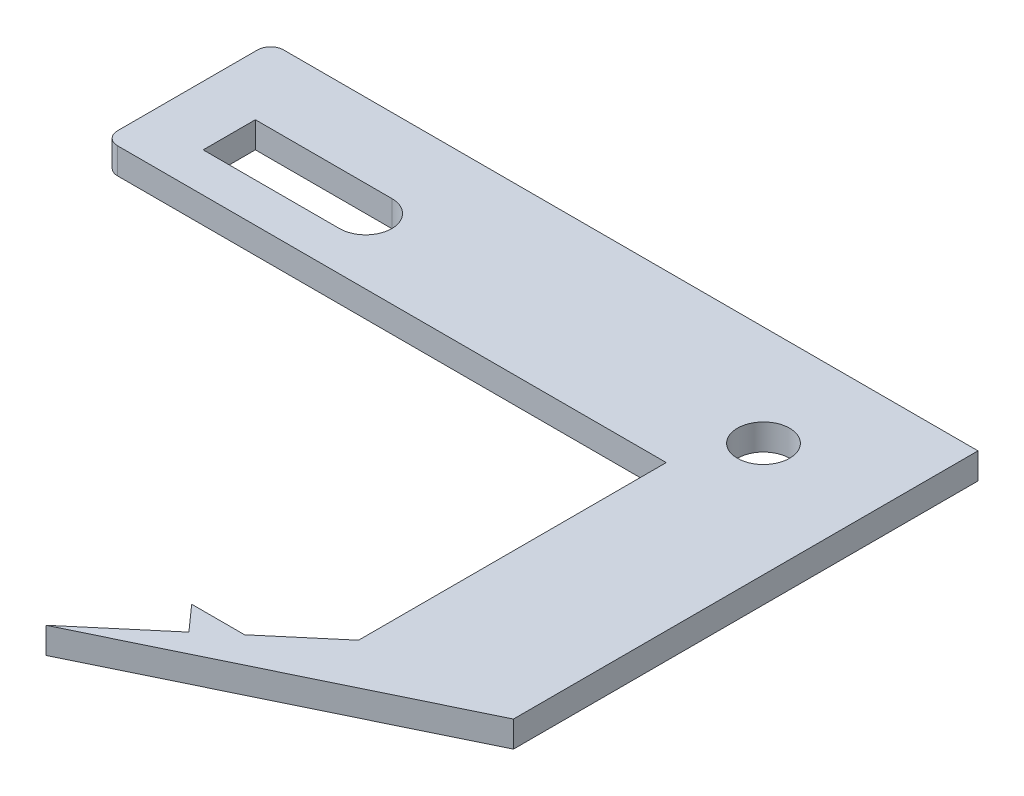
ISO-10303-21;
HEADER;
FILE_DESCRIPTION(('STEP AP214'),'2;1');
FILE_NAME('part.step','',(''),(''),'','','');
FILE_SCHEMA(('AUTOMOTIVE_DESIGN { 1 0 10303 214 1 1 1 1 }'));
ENDSEC;
DATA;
#1=APPLICATION_CONTEXT('core data for automotive mechanical design processes');
#2=APPLICATION_PROTOCOL_DEFINITION('international standard','automotive_design',2000,#1);
#3=PRODUCT_CONTEXT('',#1,'mechanical');
#4=PRODUCT('Part','Part','',(#3));
#5=PRODUCT_RELATED_PRODUCT_CATEGORY('part','',(#4));
#6=PRODUCT_DEFINITION_FORMATION('','',#4);
#7=PRODUCT_DEFINITION_CONTEXT('part definition',#1,'design');
#8=PRODUCT_DEFINITION('design','',#6,#7);
#9=PRODUCT_DEFINITION_SHAPE('','',#8);
#10=(LENGTH_UNIT() NAMED_UNIT(*) SI_UNIT(.MILLI.,.METRE.));
#11=(NAMED_UNIT(*) PLANE_ANGLE_UNIT() SI_UNIT($,.RADIAN.));
#12=(NAMED_UNIT(*) SI_UNIT($,.STERADIAN.) SOLID_ANGLE_UNIT());
#13=UNCERTAINTY_MEASURE_WITH_UNIT(LENGTH_MEASURE(1.E-05),#10,'distance_accuracy_value','');
#14=(GEOMETRIC_REPRESENTATION_CONTEXT(3) GLOBAL_UNCERTAINTY_ASSIGNED_CONTEXT((#13)) GLOBAL_UNIT_ASSIGNED_CONTEXT((#10,
#11,#12)) REPRESENTATION_CONTEXT('',''));
#15=CARTESIAN_POINT('',(0.,0.,0.));
#16=DIRECTION('',(0.,0.,1.));
#17=DIRECTION('',(1.,0.,0.));
#18=AXIS2_PLACEMENT_3D('',#15,#16,#17);
#19=CARTESIAN_POINT('',(1.,2.,-48.412862341502));
#20=DIRECTION('',(0.,1.,0.));
#21=DIRECTION('',(0.,0.,1.));
#22=AXIS2_PLACEMENT_3D('',#19,#20,#21);
#23=PLANE('',#22);
#24=CARTESIAN_POINT('',(45.48,2.,-41.7006090805018));
#25=DIRECTION('',(0.,1.,0.));
#26=DIRECTION('',(0.,0.,1.));
#27=AXIS2_PLACEMENT_3D('',#24,#25,#26);
#28=CIRCLE('',#27,2.);
#29=CARTESIAN_POINT('',(45.48,2.,-39.7006090805018));
#30=VERTEX_POINT('',#29);
#31=EDGE_CURVE('E182',#30,#30,#28,.T.);
#32=ORIENTED_EDGE('',*,*,#31,.F.);
#33=EDGE_LOOP('',(#32));
#34=FACE_BOUND('',#33,.T.);
#35=DIRECTION('',(0.,0.,1.));
#36=VECTOR('',#35,1.);
#37=CARTESIAN_POINT('',(43.0365276310284,2.,-17.1321982575454));
#38=LINE('',#37,#36);
#39=CARTESIAN_POINT('',(43.0365276310284,2.,-36.6920301733855));
#40=VERTEX_POINT('',#39);
#41=CARTESIAN_POINT('',(43.0365276310285,2.,-13.1164973616066));
#42=VERTEX_POINT('',#41);
#43=EDGE_CURVE('E188',#40,#42,#38,.T.);
#44=ORIENTED_EDGE('',*,*,#43,.T.);
#45=DIRECTION('',(-0.763095427239992,0.,0.646285826028557));
#46=VECTOR('',#45,1.);
#47=CARTESIAN_POINT('',(38.3102977408544,2.,-9.11372748573446));
#48=LINE('',#47,#46);
#49=CARTESIAN_POINT('',(38.3102977408544,2.,-9.11372748573446));
#50=VERTEX_POINT('',#49);
#51=EDGE_CURVE('E191',#42,#50,#48,.T.);
#52=ORIENTED_EDGE('',*,*,#51,.T.);
#53=DIRECTION('',(-1.,0.,0.));
#54=VECTOR('',#53,1.);
#55=CARTESIAN_POINT('',(34.2535826286052,2.,-9.11372748573446));
#56=LINE('',#55,#54);
#57=CARTESIAN_POINT('',(34.2535826286052,2.,-9.11372748573446));
#58=VERTEX_POINT('',#57);
#59=EDGE_CURVE('E194',#50,#58,#56,.T.);
#60=ORIENTED_EDGE('',*,*,#59,.T.);
#61=DIRECTION('',(0.665889755765681,0.,0.746050154591714));
#62=VECTOR('',#61,1.);
#63=CARTESIAN_POINT('',(36.,2.,-7.15707484371779));
#64=LINE('',#63,#62);
#65=CARTESIAN_POINT('',(36.,2.,-7.15707484371779));
#66=VERTEX_POINT('',#65);
#67=EDGE_CURVE('E196',#58,#66,#64,.T.);
#68=ORIENTED_EDGE('',*,*,#67,.T.);
#69=DIRECTION('',(-0.763095427239992,0.,0.646285826028557));
#70=VECTOR('',#69,1.);
#71=CARTESIAN_POINT('',(30.071702425445,2.,-2.13624185462244));
#72=LINE('',#71,#70);
#73=CARTESIAN_POINT('',(30.071702425445,2.,-2.13624185462244));
#74=VERTEX_POINT('',#73);
#75=EDGE_CURVE('E198',#66,#74,#72,.T.);
#76=ORIENTED_EDGE('',*,*,#75,.T.);
#77=DIRECTION('',(0.90001368842187,0.,-0.435861630168637));
#78=VECTOR('',#77,1.);
#79=CARTESIAN_POINT('',(30.071702425445,2.,-2.13624185462244));
#80=LINE('',#79,#78);
#81=CARTESIAN_POINT('',(54.2008321681166,2.,-13.8215772661675));
#82=VERTEX_POINT('',#81);
#83=EDGE_CURVE('E200',#74,#82,#80,.T.);
#84=ORIENTED_EDGE('',*,*,#83,.T.);
#85=DIRECTION('',(0.,0.,-1.));
#86=VECTOR('',#85,1.);
#87=CARTESIAN_POINT('',(54.2008321681166,2.,-13.8215772661675));
#88=LINE('',#87,#86);
#89=CARTESIAN_POINT('',(54.2008321681165,2.,-49.412862341502));
#90=VERTEX_POINT('',#89);
#91=EDGE_CURVE('E202',#82,#90,#88,.T.);
#92=ORIENTED_EDGE('',*,*,#91,.T.);
#93=DIRECTION('',(-1.,0.,0.));
#94=VECTOR('',#93,1.);
#95=CARTESIAN_POINT('',(41.48,2.,-49.412862341502));
#96=LINE('',#95,#94);
#97=CARTESIAN_POINT('',(1.,2.,-49.412862341502));
#98=VERTEX_POINT('',#97);
#99=EDGE_CURVE('E204',#90,#98,#96,.T.);
#100=ORIENTED_EDGE('',*,*,#99,.T.);
#101=CARTESIAN_POINT('',(1.,2.,-48.412862341502));
#102=DIRECTION('',(0.,1.,0.));
#103=DIRECTION('',(0.,0.,1.));
#104=AXIS2_PLACEMENT_3D('',#101,#102,#103);
#105=CIRCLE('',#104,1.);
#106=CARTESIAN_POINT('',(0.,2.,-48.412862341502));
#107=VERTEX_POINT('',#106);
#108=EDGE_CURVE('E206',#98,#107,#105,.T.);
#109=ORIENTED_EDGE('',*,*,#108,.T.);
#110=DIRECTION('',(0.,0.,1.));
#111=VECTOR('',#110,1.);
#112=CARTESIAN_POINT('',(0.,2.,-48.412862341502));
#113=LINE('',#112,#111);
#114=CARTESIAN_POINT('',(0.,2.,-37.6920301733855));
#115=VERTEX_POINT('',#114);
#116=EDGE_CURVE('E208',#107,#115,#113,.T.);
#117=ORIENTED_EDGE('',*,*,#116,.T.);
#118=CARTESIAN_POINT('',(1.,2.,-37.6920301733855));
#119=DIRECTION('',(0.,1.,0.));
#120=DIRECTION('',(0.,0.,-1.));
#121=AXIS2_PLACEMENT_3D('',#118,#119,#120);
#122=CIRCLE('',#121,1.);
#123=CARTESIAN_POINT('',(1.,2.,-36.6920301733855));
#124=VERTEX_POINT('',#123);
#125=EDGE_CURVE('E210',#115,#124,#122,.T.);
#126=ORIENTED_EDGE('',*,*,#125,.T.);
#127=DIRECTION('',(1.,0.,0.));
#128=VECTOR('',#127,1.);
#129=CARTESIAN_POINT('',(1.,2.,-36.6920301733855));
#130=LINE('',#129,#128);
#131=EDGE_CURVE('E212',#124,#40,#130,.T.);
#132=ORIENTED_EDGE('',*,*,#131,.T.);
#133=EDGE_LOOP('',(#44,#52,#60,#68,#76,#84,#92,#100,#109,#117,#126,#132));
#134=FACE_BOUND('',#133,.T.);
#135=DIRECTION('',(-1.,0.,0.));
#136=VECTOR('',#135,1.);
#137=CARTESIAN_POINT('',(15.,2.,-43.7006090805018));
#138=LINE('',#137,#136);
#139=CARTESIAN_POINT('',(15.,2.,-43.7006090805018));
#140=VERTEX_POINT('',#139);
#141=CARTESIAN_POINT('',(4.54951644761081,2.,-43.7006090805018));
#142=VERTEX_POINT('',#141);
#143=EDGE_CURVE('E154',#140,#142,#138,.T.);
#144=ORIENTED_EDGE('',*,*,#143,.F.);
#145=CARTESIAN_POINT('',(15.,2.,-41.7006090805018));
#146=DIRECTION('',(0.,1.,0.));
#147=DIRECTION('',(0.,0.,1.));
#148=AXIS2_PLACEMENT_3D('',#145,#146,#147);
#149=CIRCLE('',#148,2.);
#150=CARTESIAN_POINT('',(15.,2.,-39.7006090805018));
#151=VERTEX_POINT('',#150);
#152=EDGE_CURVE('E146',#151,#140,#149,.T.);
#153=ORIENTED_EDGE('',*,*,#152,.F.);
#154=DIRECTION('',(1.,0.,0.));
#155=VECTOR('',#154,1.);
#156=CARTESIAN_POINT('',(4.54951644761081,2.,-39.7006090805018));
#157=LINE('',#156,#155);
#158=CARTESIAN_POINT('',(4.54951644761081,2.,-39.7006090805018));
#159=VERTEX_POINT('',#158);
#160=EDGE_CURVE('E168',#159,#151,#157,.T.);
#161=ORIENTED_EDGE('',*,*,#160,.F.);
#162=DIRECTION('',(0.,0.,1.));
#163=VECTOR('',#162,1.);
#164=CARTESIAN_POINT('',(4.54951644761081,2.,-43.7006090805018));
#165=LINE('',#164,#163);
#166=EDGE_CURVE('E166',#142,#159,#165,.T.);
#167=ORIENTED_EDGE('',*,*,#166,.F.);
#168=EDGE_LOOP('',(#144,#153,#161,#167));
#169=FACE_BOUND('',#168,.T.);
#170=ADVANCED_FACE('F33',(#34,#134,#169),#23,.T.);
#171=CARTESIAN_POINT('',(1.,0.,-48.412862341502));
#172=DIRECTION('',(0.,1.,0.));
#173=DIRECTION('',(0.,0.,1.));
#174=AXIS2_PLACEMENT_3D('',#171,#172,#173);
#175=PLANE('',#174);
#176=CARTESIAN_POINT('',(45.48,0.,-41.7006090805018));
#177=DIRECTION('',(0.,1.,0.));
#178=DIRECTION('',(0.,0.,1.));
#179=AXIS2_PLACEMENT_3D('',#176,#177,#178);
#180=CIRCLE('',#179,2.);
#181=CARTESIAN_POINT('',(45.48,0.,-39.7006090805018));
#182=VERTEX_POINT('',#181);
#183=EDGE_CURVE('E162',#182,#182,#180,.T.);
#184=ORIENTED_EDGE('',*,*,#183,.T.);
#185=EDGE_LOOP('',(#184));
#186=FACE_BOUND('',#185,.T.);
#187=DIRECTION('',(-0.763095427239992,0.,0.646285826028557));
#188=VECTOR('',#187,1.);
#189=CARTESIAN_POINT('',(38.3102977408544,0.,-9.11372748573446));
#190=LINE('',#189,#188);
#191=CARTESIAN_POINT('',(43.0365276310285,0.,-13.1164973616066));
#192=VERTEX_POINT('',#191);
#193=CARTESIAN_POINT('',(38.3102977408544,0.,-9.11372748573446));
#194=VERTEX_POINT('',#193);
#195=EDGE_CURVE('E185',#192,#194,#190,.T.);
#196=ORIENTED_EDGE('',*,*,#195,.F.);
#197=DIRECTION('',(0.,0.,1.));
#198=VECTOR('',#197,1.);
#199=CARTESIAN_POINT('',(43.0365276310284,0.,-17.1321982575454));
#200=LINE('',#199,#198);
#201=CARTESIAN_POINT('',(43.0365276310284,0.,-36.6920301733855));
#202=VERTEX_POINT('',#201);
#203=EDGE_CURVE('E192',#202,#192,#200,.T.);
#204=ORIENTED_EDGE('',*,*,#203,.F.);
#205=DIRECTION('',(1.,0.,0.));
#206=VECTOR('',#205,1.);
#207=CARTESIAN_POINT('',(31.48,0.,-36.6920301733855));
#208=LINE('',#207,#206);
#209=CARTESIAN_POINT('',(1.,0.,-36.6920301733855));
#210=VERTEX_POINT('',#209);
#211=EDGE_CURVE('E237',#210,#202,#208,.T.);
#212=ORIENTED_EDGE('',*,*,#211,.F.);
#213=CARTESIAN_POINT('',(1.,0.,-37.6920301733855));
#214=DIRECTION('',(0.,1.,0.));
#215=DIRECTION('',(0.,0.,-1.));
#216=AXIS2_PLACEMENT_3D('',#213,#214,#215);
#217=CIRCLE('',#216,1.);
#218=CARTESIAN_POINT('',(0.,0.,-37.6920301733855));
#219=VERTEX_POINT('',#218);
#220=EDGE_CURVE('E234',#219,#210,#217,.T.);
#221=ORIENTED_EDGE('',*,*,#220,.F.);
#222=DIRECTION('',(0.,0.,1.));
#223=VECTOR('',#222,1.);
#224=CARTESIAN_POINT('',(0.,0.,-48.412862341502));
#225=LINE('',#224,#223);
#226=CARTESIAN_POINT('',(0.,0.,-48.412862341502));
#227=VERTEX_POINT('',#226);
#228=EDGE_CURVE('E232',#227,#219,#225,.T.);
#229=ORIENTED_EDGE('',*,*,#228,.F.);
#230=CARTESIAN_POINT('',(1.,0.,-48.412862341502));
#231=DIRECTION('',(0.,1.,0.));
#232=DIRECTION('',(0.,0.,1.));
#233=AXIS2_PLACEMENT_3D('',#230,#231,#232);
#234=CIRCLE('',#233,1.);
#235=CARTESIAN_POINT('',(1.,0.,-49.412862341502));
#236=VERTEX_POINT('',#235);
#237=EDGE_CURVE('E230',#236,#227,#234,.T.);
#238=ORIENTED_EDGE('',*,*,#237,.F.);
#239=DIRECTION('',(-1.,0.,0.));
#240=VECTOR('',#239,1.);
#241=CARTESIAN_POINT('',(1.,0.,-49.412862341502));
#242=LINE('',#241,#240);
#243=CARTESIAN_POINT('',(54.2008321681165,0.,-49.412862341502));
#244=VERTEX_POINT('',#243);
#245=EDGE_CURVE('E228',#244,#236,#242,.T.);
#246=ORIENTED_EDGE('',*,*,#245,.F.);
#247=DIRECTION('',(0.,0.,-1.));
#248=VECTOR('',#247,1.);
#249=CARTESIAN_POINT('',(54.2008321681165,0.,-49.412862341502));
#250=LINE('',#249,#248);
#251=CARTESIAN_POINT('',(54.2008321681166,0.,-13.8215772661675));
#252=VERTEX_POINT('',#251);
#253=EDGE_CURVE('E225',#252,#244,#250,.T.);
#254=ORIENTED_EDGE('',*,*,#253,.F.);
#255=DIRECTION('',(0.90001368842187,0.,-0.435861630168637));
#256=VECTOR('',#255,1.);
#257=CARTESIAN_POINT('',(30.071702425445,0.,-2.13624185462244));
#258=LINE('',#257,#256);
#259=CARTESIAN_POINT('',(30.071702425445,0.,-2.13624185462244));
#260=VERTEX_POINT('',#259);
#261=EDGE_CURVE('E222',#260,#252,#258,.T.);
#262=ORIENTED_EDGE('',*,*,#261,.F.);
#263=DIRECTION('',(-0.763095427239992,0.,0.646285826028557));
#264=VECTOR('',#263,1.);
#265=CARTESIAN_POINT('',(30.071702425445,0.,-2.13624185462244));
#266=LINE('',#265,#264);
#267=CARTESIAN_POINT('',(36.,0.,-7.15707484371779));
#268=VERTEX_POINT('',#267);
#269=EDGE_CURVE('E220',#268,#260,#266,.T.);
#270=ORIENTED_EDGE('',*,*,#269,.F.);
#271=DIRECTION('',(0.665889755765681,0.,0.746050154591714));
#272=VECTOR('',#271,1.);
#273=CARTESIAN_POINT('',(36.,0.,-7.15707484371779));
#274=LINE('',#273,#272);
#275=CARTESIAN_POINT('',(34.2535826286052,0.,-9.11372748573446));
#276=VERTEX_POINT('',#275);
#277=EDGE_CURVE('E218',#276,#268,#274,.T.);
#278=ORIENTED_EDGE('',*,*,#277,.F.);
#279=DIRECTION('',(-1.,0.,0.));
#280=VECTOR('',#279,1.);
#281=CARTESIAN_POINT('',(34.2535826286052,0.,-9.11372748573446));
#282=LINE('',#281,#280);
#283=EDGE_CURVE('E216',#194,#276,#282,.T.);
#284=ORIENTED_EDGE('',*,*,#283,.F.);
#285=EDGE_LOOP('',(#196,#204,#212,#221,#229,#238,#246,#254,#262,#270,#278,#284));
#286=FACE_BOUND('',#285,.T.);
#287=CARTESIAN_POINT('',(15.,0.,-41.7006090805018));
#288=DIRECTION('',(0.,1.,0.));
#289=DIRECTION('',(0.,0.,1.));
#290=AXIS2_PLACEMENT_3D('',#287,#288,#289);
#291=CIRCLE('',#290,2.);
#292=CARTESIAN_POINT('',(15.,0.,-39.7006090805018));
#293=VERTEX_POINT('',#292);
#294=CARTESIAN_POINT('',(15.,0.,-43.7006090805018));
#295=VERTEX_POINT('',#294);
#296=EDGE_CURVE('E56',#293,#295,#291,.T.);
#297=ORIENTED_EDGE('',*,*,#296,.T.);
#298=DIRECTION('',(-1.,0.,0.));
#299=VECTOR('',#298,1.);
#300=CARTESIAN_POINT('',(15.,0.,-43.7006090805018));
#301=LINE('',#300,#299);
#302=CARTESIAN_POINT('',(4.54951644761081,0.,-43.7006090805018));
#303=VERTEX_POINT('',#302);
#304=EDGE_CURVE('E161',#295,#303,#301,.T.);
#305=ORIENTED_EDGE('',*,*,#304,.T.);
#306=DIRECTION('',(0.,0.,1.));
#307=VECTOR('',#306,1.);
#308=CARTESIAN_POINT('',(4.54951644761081,0.,-43.7006090805018));
#309=LINE('',#308,#307);
#310=CARTESIAN_POINT('',(4.54951644761081,0.,-39.7006090805018));
#311=VERTEX_POINT('',#310);
#312=EDGE_CURVE('E174',#303,#311,#309,.T.);
#313=ORIENTED_EDGE('',*,*,#312,.T.);
#314=DIRECTION('',(1.,0.,0.));
#315=VECTOR('',#314,1.);
#316=CARTESIAN_POINT('',(4.54951644761081,0.,-39.7006090805018));
#317=LINE('',#316,#315);
#318=EDGE_CURVE('E155',#311,#293,#317,.T.);
#319=ORIENTED_EDGE('',*,*,#318,.T.);
#320=EDGE_LOOP('',(#297,#305,#313,#319));
#321=FACE_BOUND('',#320,.T.);
#322=ADVANCED_FACE('F280',(#186,#286,#321),#175,.F.);
#323=CARTESIAN_POINT('',(38.3102977408544,2.,-9.11372748573446));
#324=DIRECTION('',(0.646285826028557,0.,0.763095427239992));
#325=DIRECTION('',(0.763095427239992,0.,-0.646285826028557));
#326=AXIS2_PLACEMENT_3D('',#323,#324,#325);
#327=PLANE('',#326);
#328=ORIENTED_EDGE('',*,*,#195,.T.);
#329=DIRECTION('',(0.,-1.,0.));
#330=VECTOR('',#329,1.);
#331=CARTESIAN_POINT('',(38.3102977408544,2.,-9.11372748573446));
#332=LINE('',#331,#330);
#333=EDGE_CURVE('E41',#50,#194,#332,.T.);
#334=ORIENTED_EDGE('',*,*,#333,.F.);
#335=ORIENTED_EDGE('',*,*,#51,.F.);
#336=DIRECTION('',(0.,-1.,0.));
#337=VECTOR('',#336,1.);
#338=CARTESIAN_POINT('',(43.0365276310285,2.,-13.1164973616066));
#339=LINE('',#338,#337);
#340=EDGE_CURVE('E11',#42,#192,#339,.T.);
#341=ORIENTED_EDGE('',*,*,#340,.T.);
#342=EDGE_LOOP('',(#328,#334,#335,#341));
#343=FACE_BOUND('',#342,.T.);
#344=ADVANCED_FACE('F35',(#343),#327,.F.);
#345=CARTESIAN_POINT('',(34.2535826286052,2.,-9.11372748573446));
#346=DIRECTION('',(0.,0.,1.));
#347=DIRECTION('',(1.,0.,0.));
#348=AXIS2_PLACEMENT_3D('',#345,#346,#347);
#349=PLANE('',#348);
#350=ORIENTED_EDGE('',*,*,#283,.T.);
#351=DIRECTION('',(0.,-1.,0.));
#352=VECTOR('',#351,1.);
#353=CARTESIAN_POINT('',(34.2535826286052,2.,-9.11372748573446));
#354=LINE('',#353,#352);
#355=EDGE_CURVE('E267',#58,#276,#354,.T.);
#356=ORIENTED_EDGE('',*,*,#355,.F.);
#357=ORIENTED_EDGE('',*,*,#59,.F.);
#358=ORIENTED_EDGE('',*,*,#333,.T.);
#359=EDGE_LOOP('',(#350,#356,#357,#358));
#360=FACE_BOUND('',#359,.T.);
#361=ADVANCED_FACE('F274',(#360),#349,.F.);
#362=CARTESIAN_POINT('',(36.,2.,-7.15707484371779));
#363=DIRECTION('',(0.746050154591715,0.,-0.665889755765682));
#364=DIRECTION('',(-0.665889755765681,0.,-0.746050154591715));
#365=AXIS2_PLACEMENT_3D('',#362,#363,#364);
#366=PLANE('',#365);
#367=ORIENTED_EDGE('',*,*,#277,.T.);
#368=DIRECTION('',(0.,-1.,0.));
#369=VECTOR('',#368,1.);
#370=CARTESIAN_POINT('',(36.,2.,-7.15707484371779));
#371=LINE('',#370,#369);
#372=EDGE_CURVE('E264',#66,#268,#371,.T.);
#373=ORIENTED_EDGE('',*,*,#372,.F.);
#374=ORIENTED_EDGE('',*,*,#67,.F.);
#375=ORIENTED_EDGE('',*,*,#355,.T.);
#376=EDGE_LOOP('',(#367,#373,#374,#375));
#377=FACE_BOUND('',#376,.T.);
#378=ADVANCED_FACE('F286',(#377),#366,.F.);
#379=CARTESIAN_POINT('',(30.071702425445,2.,-2.13624185462244));
#380=DIRECTION('',(0.646285826028557,0.,0.763095427239992));
#381=DIRECTION('',(0.763095427239992,0.,-0.646285826028557));
#382=AXIS2_PLACEMENT_3D('',#379,#380,#381);
#383=PLANE('',#382);
#384=ORIENTED_EDGE('',*,*,#269,.T.);
#385=DIRECTION('',(0.,-1.,0.));
#386=VECTOR('',#385,1.);
#387=CARTESIAN_POINT('',(30.071702425445,2.,-2.13624185462244));
#388=LINE('',#387,#386);
#389=EDGE_CURVE('E261',#74,#260,#388,.T.);
#390=ORIENTED_EDGE('',*,*,#389,.F.);
#391=ORIENTED_EDGE('',*,*,#75,.F.);
#392=ORIENTED_EDGE('',*,*,#372,.T.);
#393=EDGE_LOOP('',(#384,#390,#391,#392));
#394=FACE_BOUND('',#393,.T.);
#395=ADVANCED_FACE('F290',(#394),#383,.F.);
#396=CARTESIAN_POINT('',(30.071702425445,2.,-2.13624185462244));
#397=DIRECTION('',(-0.435861630168637,0.,-0.90001368842187));
#398=DIRECTION('',(-0.90001368842187,0.,0.435861630168637));
#399=AXIS2_PLACEMENT_3D('',#396,#397,#398);
#400=PLANE('',#399);
#401=ORIENTED_EDGE('',*,*,#261,.T.);
#402=DIRECTION('',(0.,-1.,0.));
#403=VECTOR('',#402,1.);
#404=CARTESIAN_POINT('',(54.2008321681166,2.,-13.8215772661675));
#405=LINE('',#404,#403);
#406=EDGE_CURVE('E258',#82,#252,#405,.T.);
#407=ORIENTED_EDGE('',*,*,#406,.F.);
#408=ORIENTED_EDGE('',*,*,#83,.F.);
#409=ORIENTED_EDGE('',*,*,#389,.T.);
#410=EDGE_LOOP('',(#401,#407,#408,#409));
#411=FACE_BOUND('',#410,.T.);
#412=ADVANCED_FACE('F327',(#411),#400,.F.);
#413=CARTESIAN_POINT('',(54.2008321681165,2.,-49.412862341502));
#414=DIRECTION('',(-1.,0.,0.));
#415=DIRECTION('',(0.,0.,1.));
#416=AXIS2_PLACEMENT_3D('',#413,#414,#415);
#417=PLANE('',#416);
#418=ORIENTED_EDGE('',*,*,#253,.T.);
#419=DIRECTION('',(0.,-1.,0.));
#420=VECTOR('',#419,1.);
#421=CARTESIAN_POINT('',(54.2008321681165,2.,-49.412862341502));
#422=LINE('',#421,#420);
#423=EDGE_CURVE('E255',#90,#244,#422,.T.);
#424=ORIENTED_EDGE('',*,*,#423,.F.);
#425=ORIENTED_EDGE('',*,*,#91,.F.);
#426=ORIENTED_EDGE('',*,*,#406,.T.);
#427=EDGE_LOOP('',(#418,#424,#425,#426));
#428=FACE_BOUND('',#427,.T.);
#429=ADVANCED_FACE('F324',(#428),#417,.F.);
#430=CARTESIAN_POINT('',(1.,2.,-49.412862341502));
#431=DIRECTION('',(0.,0.,1.));
#432=DIRECTION('',(1.,0.,0.));
#433=AXIS2_PLACEMENT_3D('',#430,#431,#432);
#434=PLANE('',#433);
#435=ORIENTED_EDGE('',*,*,#245,.T.);
#436=DIRECTION('',(0.,-1.,0.));
#437=VECTOR('',#436,1.);
#438=CARTESIAN_POINT('',(1.,2.,-49.412862341502));
#439=LINE('',#438,#437);
#440=EDGE_CURVE('E252',#98,#236,#439,.T.);
#441=ORIENTED_EDGE('',*,*,#440,.F.);
#442=ORIENTED_EDGE('',*,*,#99,.F.);
#443=ORIENTED_EDGE('',*,*,#423,.T.);
#444=EDGE_LOOP('',(#435,#441,#442,#443));
#445=FACE_BOUND('',#444,.T.);
#446=ADVANCED_FACE('F321',(#445),#434,.F.);
#447=CARTESIAN_POINT('',(1.,2.,-48.412862341502));
#448=DIRECTION('',(0.,-1.,0.));
#449=DIRECTION('',(0.,0.,-1.));
#450=AXIS2_PLACEMENT_3D('',#447,#448,#449);
#451=CYLINDRICAL_SURFACE('',#450,1.);
#452=ORIENTED_EDGE('',*,*,#237,.T.);
#453=DIRECTION('',(0.,-1.,0.));
#454=VECTOR('',#453,1.);
#455=CARTESIAN_POINT('',(0.,2.,-48.412862341502));
#456=LINE('',#455,#454);
#457=EDGE_CURVE('E249',#107,#227,#456,.T.);
#458=ORIENTED_EDGE('',*,*,#457,.F.);
#459=ORIENTED_EDGE('',*,*,#108,.F.);
#460=ORIENTED_EDGE('',*,*,#440,.T.);
#461=EDGE_LOOP('',(#452,#458,#459,#460));
#462=FACE_BOUND('',#461,.T.);
#463=ADVANCED_FACE('F317',(#462),#451,.T.);
#464=CARTESIAN_POINT('',(0.,2.,-48.412862341502));
#465=DIRECTION('',(1.,0.,0.));
#466=DIRECTION('',(0.,0.,-1.));
#467=AXIS2_PLACEMENT_3D('',#464,#465,#466);
#468=PLANE('',#467);
#469=ORIENTED_EDGE('',*,*,#228,.T.);
#470=DIRECTION('',(0.,-1.,0.));
#471=VECTOR('',#470,1.);
#472=CARTESIAN_POINT('',(0.,2.,-37.6920301733855));
#473=LINE('',#472,#471);
#474=EDGE_CURVE('E246',#115,#219,#473,.T.);
#475=ORIENTED_EDGE('',*,*,#474,.F.);
#476=ORIENTED_EDGE('',*,*,#116,.F.);
#477=ORIENTED_EDGE('',*,*,#457,.T.);
#478=EDGE_LOOP('',(#469,#475,#476,#477));
#479=FACE_BOUND('',#478,.T.);
#480=ADVANCED_FACE('F312',(#479),#468,.F.);
#481=CARTESIAN_POINT('',(1.,2.,-37.6920301733855));
#482=DIRECTION('',(0.,-1.,0.));
#483=DIRECTION('',(0.,0.,-1.));
#484=AXIS2_PLACEMENT_3D('',#481,#482,#483);
#485=CYLINDRICAL_SURFACE('',#484,1.);
#486=ORIENTED_EDGE('',*,*,#220,.T.);
#487=DIRECTION('',(0.,-1.,0.));
#488=VECTOR('',#487,1.);
#489=CARTESIAN_POINT('',(1.,2.,-36.6920301733855));
#490=LINE('',#489,#488);
#491=EDGE_CURVE('E243',#124,#210,#490,.T.);
#492=ORIENTED_EDGE('',*,*,#491,.F.);
#493=ORIENTED_EDGE('',*,*,#125,.F.);
#494=ORIENTED_EDGE('',*,*,#474,.T.);
#495=EDGE_LOOP('',(#486,#492,#493,#494));
#496=FACE_BOUND('',#495,.T.);
#497=ADVANCED_FACE('F307',(#496),#485,.T.);
#498=CARTESIAN_POINT('',(31.48,2.,-36.6920301733855));
#499=DIRECTION('',(0.,0.,-1.));
#500=DIRECTION('',(-1.,0.,0.));
#501=AXIS2_PLACEMENT_3D('',#498,#499,#500);
#502=PLANE('',#501);
#503=ORIENTED_EDGE('',*,*,#211,.T.);
#504=DIRECTION('',(0.,-1.,0.));
#505=VECTOR('',#504,1.);
#506=CARTESIAN_POINT('',(43.0365276310284,2.,-36.6920301733855));
#507=LINE('',#506,#505);
#508=EDGE_CURVE('E214',#40,#202,#507,.T.);
#509=ORIENTED_EDGE('',*,*,#508,.F.);
#510=ORIENTED_EDGE('',*,*,#131,.F.);
#511=ORIENTED_EDGE('',*,*,#491,.T.);
#512=EDGE_LOOP('',(#503,#509,#510,#511));
#513=FACE_BOUND('',#512,.T.);
#514=ADVANCED_FACE('F302',(#513),#502,.F.);
#515=CARTESIAN_POINT('',(43.0365276310284,2.,-17.1321982575454));
#516=DIRECTION('',(1.,0.,0.));
#517=DIRECTION('',(0.,0.,-1.));
#518=AXIS2_PLACEMENT_3D('',#515,#516,#517);
#519=PLANE('',#518);
#520=ORIENTED_EDGE('',*,*,#203,.T.);
#521=ORIENTED_EDGE('',*,*,#340,.F.);
#522=ORIENTED_EDGE('',*,*,#43,.F.);
#523=ORIENTED_EDGE('',*,*,#508,.T.);
#524=EDGE_LOOP('',(#520,#521,#522,#523));
#525=FACE_BOUND('',#524,.T.);
#526=ADVANCED_FACE('F298',(#525),#519,.F.);
#527=CARTESIAN_POINT('',(45.48,2.,-41.7006090805018));
#528=DIRECTION('',(0.,-1.,0.));
#529=DIRECTION('',(0.,0.,-1.));
#530=AXIS2_PLACEMENT_3D('',#527,#528,#529);
#531=CYLINDRICAL_SURFACE('',#530,2.);
#532=ORIENTED_EDGE('',*,*,#31,.T.);
#533=EDGE_LOOP('',(#532));
#534=FACE_BOUND('',#533,.T.);
#535=ORIENTED_EDGE('',*,*,#183,.F.);
#536=EDGE_LOOP('',(#535));
#537=FACE_BOUND('',#536,.T.);
#538=ADVANCED_FACE('F346',(#534,#537),#531,.F.);
#539=CARTESIAN_POINT('',(15.,2.,-41.7006090805018));
#540=DIRECTION('',(0.,-1.,0.));
#541=DIRECTION('',(0.,0.,-1.));
#542=AXIS2_PLACEMENT_3D('',#539,#540,#541);
#543=CYLINDRICAL_SURFACE('',#542,2.);
#544=ORIENTED_EDGE('',*,*,#296,.F.);
#545=DIRECTION('',(0.,-1.,0.));
#546=VECTOR('',#545,1.);
#547=CARTESIAN_POINT('',(15.,2.,-39.7006090805018));
#548=LINE('',#547,#546);
#549=EDGE_CURVE('E150',#151,#293,#548,.T.);
#550=ORIENTED_EDGE('',*,*,#549,.F.);
#551=ORIENTED_EDGE('',*,*,#152,.T.);
#552=DIRECTION('',(0.,-1.,0.));
#553=VECTOR('',#552,1.);
#554=CARTESIAN_POINT('',(15.,2.,-43.7006090805018));
#555=LINE('',#554,#553);
#556=EDGE_CURVE('E149',#140,#295,#555,.T.);
#557=ORIENTED_EDGE('',*,*,#556,.T.);
#558=EDGE_LOOP('',(#544,#550,#551,#557));
#559=FACE_BOUND('',#558,.T.);
#560=ADVANCED_FACE('F148',(#559),#543,.F.);
#561=CARTESIAN_POINT('',(15.,2.,-43.7006090805018));
#562=DIRECTION('',(0.,0.,1.));
#563=DIRECTION('',(1.,0.,0.));
#564=AXIS2_PLACEMENT_3D('',#561,#562,#563);
#565=PLANE('',#564);
#566=ORIENTED_EDGE('',*,*,#304,.F.);
#567=ORIENTED_EDGE('',*,*,#556,.F.);
#568=ORIENTED_EDGE('',*,*,#143,.T.);
#569=DIRECTION('',(0.,-1.,0.));
#570=VECTOR('',#569,1.);
#571=CARTESIAN_POINT('',(4.54951644761081,2.,-43.7006090805018));
#572=LINE('',#571,#570);
#573=EDGE_CURVE('E163',#142,#303,#572,.T.);
#574=ORIENTED_EDGE('',*,*,#573,.T.);
#575=EDGE_LOOP('',(#566,#567,#568,#574));
#576=FACE_BOUND('',#575,.T.);
#577=ADVANCED_FACE('F158',(#576),#565,.T.);
#578=CARTESIAN_POINT('',(4.54951644761081,2.,-43.7006090805018));
#579=DIRECTION('',(1.,0.,0.));
#580=DIRECTION('',(0.,0.,-1.));
#581=AXIS2_PLACEMENT_3D('',#578,#579,#580);
#582=PLANE('',#581);
#583=ORIENTED_EDGE('',*,*,#312,.F.);
#584=ORIENTED_EDGE('',*,*,#573,.F.);
#585=ORIENTED_EDGE('',*,*,#166,.T.);
#586=DIRECTION('',(0.,-1.,0.));
#587=VECTOR('',#586,1.);
#588=CARTESIAN_POINT('',(4.54951644761081,2.,-39.7006090805018));
#589=LINE('',#588,#587);
#590=EDGE_CURVE('E48',#159,#311,#589,.T.);
#591=ORIENTED_EDGE('',*,*,#590,.T.);
#592=EDGE_LOOP('',(#583,#584,#585,#591));
#593=FACE_BOUND('',#592,.T.);
#594=ADVANCED_FACE('F401',(#593),#582,.T.);
#595=CARTESIAN_POINT('',(4.54951644761081,2.,-39.7006090805018));
#596=DIRECTION('',(0.,0.,-1.));
#597=DIRECTION('',(-1.,0.,0.));
#598=AXIS2_PLACEMENT_3D('',#595,#596,#597);
#599=PLANE('',#598);
#600=ORIENTED_EDGE('',*,*,#318,.F.);
#601=ORIENTED_EDGE('',*,*,#590,.F.);
#602=ORIENTED_EDGE('',*,*,#160,.T.);
#603=ORIENTED_EDGE('',*,*,#549,.T.);
#604=EDGE_LOOP('',(#600,#601,#602,#603));
#605=FACE_BOUND('',#604,.T.);
#606=ADVANCED_FACE('F408',(#605),#599,.T.);
#607=CLOSED_SHELL('',(#170,#322,#344,#361,#378,#395,#412,#429,#446,#463,#480,#497,#514,#526,
#538,#560,#577,#594,#606));
#608=MANIFOLD_SOLID_BREP('B2',#607);
#609=ADVANCED_BREP_SHAPE_REPRESENTATION('',(#18,#608),#14);
#610=SHAPE_DEFINITION_REPRESENTATION(#9,#609);
ENDSEC;
END-ISO-10303-21;
